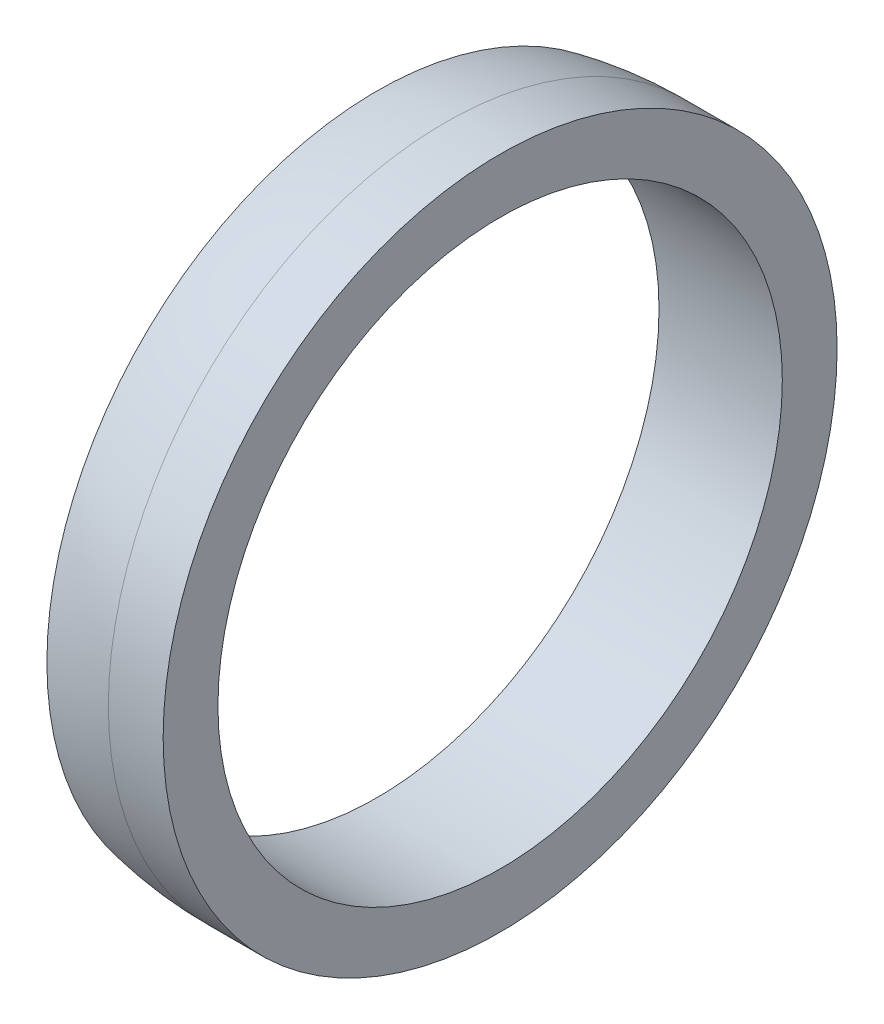
ISO-10303-21;
HEADER;
FILE_DESCRIPTION(('STEP AP214'),'2;1');
FILE_NAME('part.step','',(''),(''),'','','');
FILE_SCHEMA(('AUTOMOTIVE_DESIGN { 1 0 10303 214 1 1 1 1 }'));
ENDSEC;
DATA;
#1=APPLICATION_CONTEXT('core data for automotive mechanical design processes');
#2=APPLICATION_PROTOCOL_DEFINITION('international standard','automotive_design',2000,#1);
#3=PRODUCT_CONTEXT('',#1,'mechanical');
#4=PRODUCT('Part','Part','',(#3));
#5=PRODUCT_RELATED_PRODUCT_CATEGORY('part','',(#4));
#6=PRODUCT_DEFINITION_FORMATION('','',#4);
#7=PRODUCT_DEFINITION_CONTEXT('part definition',#1,'design');
#8=PRODUCT_DEFINITION('design','',#6,#7);
#9=PRODUCT_DEFINITION_SHAPE('','',#8);
#10=(LENGTH_UNIT() NAMED_UNIT(*) SI_UNIT(.MILLI.,.METRE.));
#11=(NAMED_UNIT(*) PLANE_ANGLE_UNIT() SI_UNIT($,.RADIAN.));
#12=(NAMED_UNIT(*) SI_UNIT($,.STERADIAN.) SOLID_ANGLE_UNIT());
#13=UNCERTAINTY_MEASURE_WITH_UNIT(LENGTH_MEASURE(1.E-05),#10,'distance_accuracy_value','');
#14=(GEOMETRIC_REPRESENTATION_CONTEXT(3) GLOBAL_UNCERTAINTY_ASSIGNED_CONTEXT((#13)) GLOBAL_UNIT_ASSIGNED_CONTEXT((#10,
#11,#12)) REPRESENTATION_CONTEXT('',''));
#15=CARTESIAN_POINT('',(0.,0.,0.));
#16=DIRECTION('',(0.,0.,1.));
#17=DIRECTION('',(1.,0.,0.));
#18=AXIS2_PLACEMENT_3D('',#15,#16,#17);
#19=CARTESIAN_POINT('',(0.,0.,0.));
#20=DIRECTION('',(-1.,0.,0.));
#21=DIRECTION('',(0.,1.,0.));
#22=AXIS2_PLACEMENT_3D('',#19,#20,#21);
#23=SPHERICAL_SURFACE('',#22,246.);
#24=CARTESIAN_POINT('',(-50.,0.,0.));
#25=DIRECTION('',(-1.,0.,0.));
#26=DIRECTION('',(0.,0.,1.));
#27=AXIS2_PLACEMENT_3D('',#24,#25,#26);
#28=CIRCLE('',#27,240.865107477194);
#29=CARTESIAN_POINT('',(-50.,0.,240.865107477194));
#30=VERTEX_POINT('',#29);
#31=EDGE_CURVE('E44',#30,#30,#28,.T.);
#32=ORIENTED_EDGE('',*,*,#31,.F.);
#33=EDGE_LOOP('',(#32));
#34=FACE_BOUND('',#33,.T.);
#35=CARTESIAN_POINT('',(0.,0.,0.));
#36=DIRECTION('',(1.,0.,0.));
#37=DIRECTION('',(0.,0.,-1.));
#38=AXIS2_PLACEMENT_3D('',#35,#36,#37);
#39=CIRCLE('',#38,246.);
#40=CARTESIAN_POINT('',(0.,0.,-246.));
#41=VERTEX_POINT('',#40);
#42=EDGE_CURVE('E54',#41,#41,#39,.T.);
#43=ORIENTED_EDGE('',*,*,#42,.F.);
#44=EDGE_LOOP('',(#43));
#45=FACE_BOUND('',#44,.T.);
#46=ADVANCED_FACE('F37',(#34,#45),#23,.T.);
#47=CARTESIAN_POINT('',(0.,0.,0.));
#48=DIRECTION('',(-1.,0.,0.));
#49=DIRECTION('',(0.,0.,1.));
#50=AXIS2_PLACEMENT_3D('',#47,#48,#49);
#51=CYLINDRICAL_SURFACE('',#50,206.);
#52=CARTESIAN_POINT('',(-50.,0.,0.));
#53=DIRECTION('',(-1.,0.,0.));
#54=DIRECTION('',(0.,0.,1.));
#55=AXIS2_PLACEMENT_3D('',#52,#53,#54);
#56=CIRCLE('',#55,206.);
#57=CARTESIAN_POINT('',(-50.,0.,206.));
#58=VERTEX_POINT('',#57);
#59=EDGE_CURVE('E10',#58,#58,#56,.T.);
#60=ORIENTED_EDGE('',*,*,#59,.T.);
#61=EDGE_LOOP('',(#60));
#62=FACE_BOUND('',#61,.T.);
#63=CARTESIAN_POINT('',(40.,0.,0.));
#64=DIRECTION('',(1.,0.,0.));
#65=DIRECTION('',(0.,0.,-1.));
#66=AXIS2_PLACEMENT_3D('',#63,#64,#65);
#67=CIRCLE('',#66,206.);
#68=CARTESIAN_POINT('',(40.,0.,-206.));
#69=VERTEX_POINT('',#68);
#70=EDGE_CURVE('E59',#69,#69,#67,.T.);
#71=ORIENTED_EDGE('',*,*,#70,.T.);
#72=EDGE_LOOP('',(#71));
#73=FACE_BOUND('',#72,.T.);
#74=ADVANCED_FACE('F65',(#62,#73),#51,.F.);
#75=CARTESIAN_POINT('',(-50.,240.865107477194,0.));
#76=DIRECTION('',(1.,0.,0.));
#77=DIRECTION('',(0.,0.,-1.));
#78=AXIS2_PLACEMENT_3D('',#75,#76,#77);
#79=PLANE('',#78);
#80=ORIENTED_EDGE('',*,*,#59,.F.);
#81=EDGE_LOOP('',(#80));
#82=FACE_BOUND('',#81,.T.);
#83=ORIENTED_EDGE('',*,*,#31,.T.);
#84=EDGE_LOOP('',(#83));
#85=FACE_BOUND('',#84,.T.);
#86=ADVANCED_FACE('F70',(#82,#85),#79,.F.);
#87=CARTESIAN_POINT('',(40.,0.,0.));
#88=DIRECTION('',(1.,0.,0.));
#89=DIRECTION('',(0.,0.,-1.));
#90=AXIS2_PLACEMENT_3D('',#87,#88,#89);
#91=PLANE('',#90);
#92=CARTESIAN_POINT('',(40.,0.,0.));
#93=DIRECTION('',(1.,0.,0.));
#94=DIRECTION('',(0.,0.,-1.));
#95=AXIS2_PLACEMENT_3D('',#92,#93,#94);
#96=CIRCLE('',#95,246.);
#97=CARTESIAN_POINT('',(40.,0.,-246.));
#98=VERTEX_POINT('',#97);
#99=EDGE_CURVE('E49',#98,#98,#96,.T.);
#100=ORIENTED_EDGE('',*,*,#99,.T.);
#101=EDGE_LOOP('',(#100));
#102=FACE_BOUND('',#101,.T.);
#103=ORIENTED_EDGE('',*,*,#70,.F.);
#104=EDGE_LOOP('',(#103));
#105=FACE_BOUND('',#104,.T.);
#106=ADVANCED_FACE('F67',(#102,#105),#91,.T.);
#107=CARTESIAN_POINT('',(40.,0.,0.));
#108=DIRECTION('',(-1.,0.,0.));
#109=DIRECTION('',(0.,0.,1.));
#110=AXIS2_PLACEMENT_3D('',#107,#108,#109);
#111=CYLINDRICAL_SURFACE('',#110,246.);
#112=ORIENTED_EDGE('',*,*,#99,.F.);
#113=EDGE_LOOP('',(#112));
#114=FACE_BOUND('',#113,.T.);
#115=ORIENTED_EDGE('',*,*,#42,.T.);
#116=EDGE_LOOP('',(#115));
#117=FACE_BOUND('',#116,.T.);
#118=ADVANCED_FACE('F69',(#114,#117),#111,.T.);
#119=CLOSED_SHELL('',(#46,#74,#86,#106,#118));
#120=MANIFOLD_SOLID_BREP('B2',#119);
#121=ADVANCED_BREP_SHAPE_REPRESENTATION('',(#18,#120),#14);
#122=SHAPE_DEFINITION_REPRESENTATION(#9,#121);
ENDSEC;
END-ISO-10303-21;
